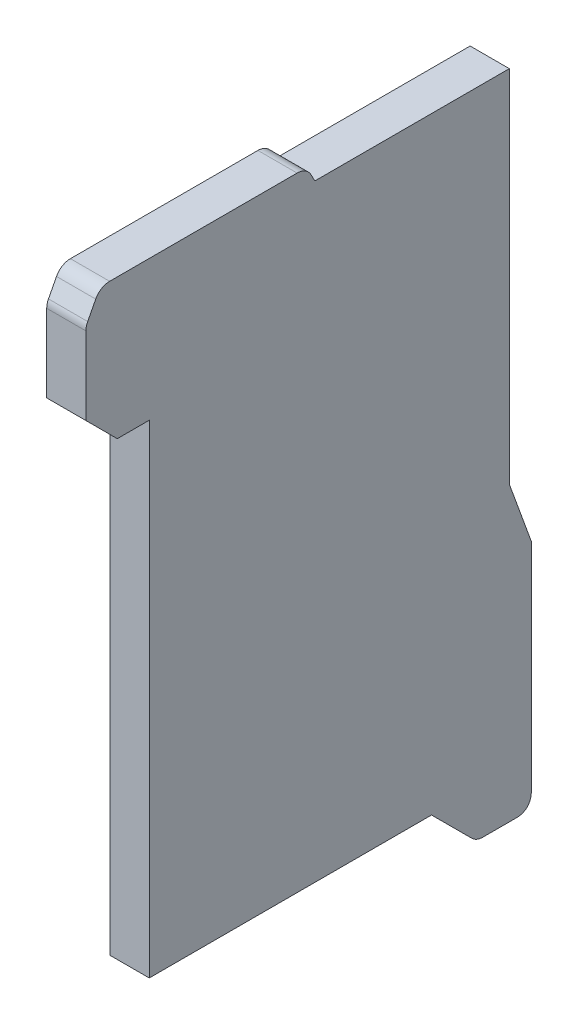
ISO-10303-21;
HEADER;
FILE_DESCRIPTION(('STEP AP214'),'2;1');
FILE_NAME('part.step','',(''),(''),'','','');
FILE_SCHEMA(('AUTOMOTIVE_DESIGN { 1 0 10303 214 1 1 1 1 }'));
ENDSEC;
DATA;
#1=APPLICATION_CONTEXT('core data for automotive mechanical design processes');
#2=APPLICATION_PROTOCOL_DEFINITION('international standard','automotive_design',2000,#1);
#3=PRODUCT_CONTEXT('',#1,'mechanical');
#4=PRODUCT('Part','Part','',(#3));
#5=PRODUCT_RELATED_PRODUCT_CATEGORY('part','',(#4));
#6=PRODUCT_DEFINITION_FORMATION('','',#4);
#7=PRODUCT_DEFINITION_CONTEXT('part definition',#1,'design');
#8=PRODUCT_DEFINITION('design','',#6,#7);
#9=PRODUCT_DEFINITION_SHAPE('','',#8);
#10=(LENGTH_UNIT() NAMED_UNIT(*) SI_UNIT(.MILLI.,.METRE.));
#11=(NAMED_UNIT(*) PLANE_ANGLE_UNIT() SI_UNIT($,.RADIAN.));
#12=(NAMED_UNIT(*) SI_UNIT($,.STERADIAN.) SOLID_ANGLE_UNIT());
#13=UNCERTAINTY_MEASURE_WITH_UNIT(LENGTH_MEASURE(1.E-05),#10,'distance_accuracy_value','');
#14=(GEOMETRIC_REPRESENTATION_CONTEXT(3) GLOBAL_UNCERTAINTY_ASSIGNED_CONTEXT((#13)) GLOBAL_UNIT_ASSIGNED_CONTEXT((#10,
#11,#12)) REPRESENTATION_CONTEXT('',''));
#15=CARTESIAN_POINT('',(0.,0.,0.));
#16=DIRECTION('',(0.,0.,1.));
#17=DIRECTION('',(1.,0.,0.));
#18=AXIS2_PLACEMENT_3D('',#15,#16,#17);
#19=CARTESIAN_POINT('',(-0.064326898654,-13.05343535686,1.691472156339));
#20=DIRECTION('',(1.,0.,0.));
#21=DIRECTION('',(0.,0.935066266637823,0.354472956649733));
#22=AXIS2_PLACEMENT_3D('',#19,#20,#21);
#23=CYLINDRICAL_SURFACE('',#22,0.1);
#24=CARTESIAN_POINT('',(-0.064326898654,-13.05343535686,1.691472156339));
#25=DIRECTION('',(-1.,0.,0.));
#26=DIRECTION('',(0.,1.,0.));
#27=AXIS2_PLACEMENT_3D('',#24,#25,#26);
#28=CIRCLE('',#27,0.1);
#29=CARTESIAN_POINT('',(-0.064326898654,-13.12830514146,1.6251810155));
#30=VERTEX_POINT('',#29);
#31=CARTESIAN_POINT('',(-0.064326898654,-13.15343535686,1.691472156339));
#32=VERTEX_POINT('',#31);
#33=EDGE_CURVE('E11',#30,#32,#28,.T.);
#34=ORIENTED_EDGE('',*,*,#33,.F.);
#35=DIRECTION('',(1.,0.,0.));
#36=VECTOR('',#35,1.);
#37=CARTESIAN_POINT('',(0.060673101346,-13.12830514146,1.6251810155));
#38=LINE('',#37,#36);
#39=CARTESIAN_POINT('',(0.185673101346,-13.12830514146,1.6251810155));
#40=VERTEX_POINT('',#39);
#41=EDGE_CURVE('E25',#30,#40,#38,.T.);
#42=ORIENTED_EDGE('',*,*,#41,.T.);
#43=CARTESIAN_POINT('',(0.185673101346,-13.05343535686,1.691472156339));
#44=DIRECTION('',(1.,0.,0.));
#45=DIRECTION('',(0.,1.,0.));
#46=AXIS2_PLACEMENT_3D('',#43,#44,#45);
#47=CIRCLE('',#46,0.1);
#48=CARTESIAN_POINT('',(0.185673101346,-13.15343535686,1.691472156339));
#49=VERTEX_POINT('',#48);
#50=EDGE_CURVE('E319',#49,#40,#47,.T.);
#51=ORIENTED_EDGE('',*,*,#50,.F.);
#52=DIRECTION('',(1.,0.,0.));
#53=VECTOR('',#52,1.);
#54=CARTESIAN_POINT('',(-0.064326898654,-13.15343535686,1.691472156339));
#55=LINE('',#54,#53);
#56=EDGE_CURVE('E314',#32,#49,#55,.T.);
#57=ORIENTED_EDGE('',*,*,#56,.F.);
#58=EDGE_LOOP('',(#34,#42,#51,#57));
#59=FACE_BOUND('',#58,.T.);
#60=ADVANCED_FACE('F17',(#59),#23,.T.);
#61=CARTESIAN_POINT('',(-0.064326898654,-13.15343535686,1.950050800102));
#62=DIRECTION('',(0.,1.,0.));
#63=DIRECTION('',(0.,0.,-1.));
#64=AXIS2_PLACEMENT_3D('',#61,#62,#63);
#65=PLANE('',#64);
#66=DIRECTION('',(0.,0.,1.));
#67=VECTOR('',#66,1.);
#68=CARTESIAN_POINT('',(0.185673101346,-13.15343535686,1.950050800102));
#69=LINE('',#68,#67);
#70=CARTESIAN_POINT('',(0.185673101346,-13.15343535686,1.908629443865));
#71=VERTEX_POINT('',#70);
#72=EDGE_CURVE('E310',#49,#71,#69,.T.);
#73=ORIENTED_EDGE('',*,*,#72,.T.);
#74=DIRECTION('',(-1.,0.,0.));
#75=VECTOR('',#74,1.);
#76=CARTESIAN_POINT('',(-0.064326898654,-13.15343535686,1.908629443865));
#77=LINE('',#76,#75);
#78=CARTESIAN_POINT('',(-0.064326898654,-13.15343535686,1.908629443865));
#79=VERTEX_POINT('',#78);
#80=EDGE_CURVE('E306',#71,#79,#77,.T.);
#81=ORIENTED_EDGE('',*,*,#80,.T.);
#82=DIRECTION('',(0.,0.,1.));
#83=VECTOR('',#82,1.);
#84=CARTESIAN_POINT('',(-0.064326898654,-13.15343535686,1.950050800102));
#85=LINE('',#84,#83);
#86=EDGE_CURVE('E301',#32,#79,#85,.T.);
#87=ORIENTED_EDGE('',*,*,#86,.F.);
#88=ORIENTED_EDGE('',*,*,#56,.T.);
#89=EDGE_LOOP('',(#73,#81,#87,#88));
#90=FACE_BOUND('',#89,.T.);
#91=ADVANCED_FACE('F334',(#90),#65,.F.);
#92=CARTESIAN_POINT('',(-0.064326898654,-9.003435356864,3.215050800102));
#93=DIRECTION('',(1.,0.,0.));
#94=DIRECTION('',(0.,1.,0.));
#95=AXIS2_PLACEMENT_3D('',#92,#93,#94);
#96=PLANE('',#95);
#97=DIRECTION('',(0.,1.,0.));
#98=VECTOR('',#97,1.);
#99=CARTESIAN_POINT('',(-0.064326898654,-9.067474943962,4.440050800102));
#100=LINE('',#99,#98);
#101=CARTESIAN_POINT('',(-0.064326898654,-9.587014667728,4.440050800102));
#102=VERTEX_POINT('',#101);
#103=CARTESIAN_POINT('',(-0.064326898654,-9.091912334242,4.440050800102));
#104=VERTEX_POINT('',#103);
#105=EDGE_CURVE('E297',#102,#104,#100,.T.);
#106=ORIENTED_EDGE('',*,*,#105,.T.);
#107=CARTESIAN_POINT('',(-0.064326898654,-9.091912334242,4.340050800102));
#108=DIRECTION('',(-1.,0.,0.));
#109=DIRECTION('',(0.,1.,0.));
#110=AXIS2_PLACEMENT_3D('',#107,#108,#109);
#111=CIRCLE('',#110,0.1);
#112=CARTESIAN_POINT('',(-0.064326898654,-9.045791807191,4.428780146908));
#113=VERTEX_POINT('',#112);
#114=EDGE_CURVE('E293',#104,#113,#111,.T.);
#115=ORIENTED_EDGE('',*,*,#114,.T.);
#116=DIRECTION('',(0.,0.887293468057386,-0.4612052705062));
#117=VECTOR('',#116,1.);
#118=CARTESIAN_POINT('',(-0.064326898654,-8.893435356864,4.349586959517));
#119=LINE('',#118,#117);
#120=CARTESIAN_POINT('',(-0.064326898654,-8.947314829813,4.377592909962));
#121=VERTEX_POINT('',#120);
#122=EDGE_CURVE('E289',#113,#121,#119,.T.);
#123=ORIENTED_EDGE('',*,*,#122,.T.);
#124=CARTESIAN_POINT('',(-0.064326898654,-8.993435356864,4.288863563156));
#125=DIRECTION('',(-1.,0.,0.));
#126=DIRECTION('',(0.,1.,0.));
#127=AXIS2_PLACEMENT_3D('',#124,#125,#126);
#128=CIRCLE('',#127,0.1);
#129=CARTESIAN_POINT('',(-0.064326898654,-8.893435356864,4.288863563156));
#130=VERTEX_POINT('',#129);
#131=EDGE_CURVE('E165',#121,#130,#128,.T.);
#132=ORIENTED_EDGE('',*,*,#131,.T.);
#133=DIRECTION('',(0.,0.,-1.));
#134=VECTOR('',#133,1.);
#135=CARTESIAN_POINT('',(-0.064326898654,-8.893435356864,3.033250954698));
#136=LINE('',#135,#134);
#137=CARTESIAN_POINT('',(-0.064326898654,-8.893435356864,3.093333203541));
#138=VERTEX_POINT('',#137);
#139=EDGE_CURVE('E282',#130,#138,#136,.T.);
#140=ORIENTED_EDGE('',*,*,#139,.T.);
#141=CARTESIAN_POINT('',(-0.064326898654,-8.993435356864,3.093333203541));
#142=DIRECTION('',(-1.,0.,0.));
#143=DIRECTION('',(0.,1.,0.));
#144=AXIS2_PLACEMENT_3D('',#141,#142,#143);
#145=CIRCLE('',#144,0.1);
#146=CARTESIAN_POINT('',(-0.064326898654,-8.946483253259,3.005041074973));
#147=VERTEX_POINT('',#146);
#148=EDGE_CURVE('E278',#138,#147,#145,.T.);
#149=ORIENTED_EDGE('',*,*,#148,.T.);
#150=DIRECTION('',(0.,-0.882921285677773,-0.469521036053879));
#151=VECTOR('',#150,1.);
#152=CARTESIAN_POINT('',(-0.064326898654,-8.893435356864,3.033250954698));
#153=LINE('',#152,#151);
#154=CARTESIAN_POINT('',(-0.064326898654,-8.993435356864,2.98007282391));
#155=VERTEX_POINT('',#154);
#156=EDGE_CURVE('E274',#147,#155,#153,.T.);
#157=ORIENTED_EDGE('',*,*,#156,.T.);
#158=DIRECTION('',(0.,0.,-1.));
#159=VECTOR('',#158,1.);
#160=CARTESIAN_POINT('',(-0.064326898654,-8.993435356864,2.98007282391));
#161=LINE('',#160,#159);
#162=CARTESIAN_POINT('',(-0.064326898654,-8.993435356864,1.740050800102));
#163=VERTEX_POINT('',#162);
#164=EDGE_CURVE('E270',#155,#163,#161,.T.);
#165=ORIENTED_EDGE('',*,*,#164,.T.);
#166=DIRECTION('',(0.,-1.,0.));
#167=VECTOR('',#166,1.);
#168=CARTESIAN_POINT('',(-0.064326898654,-11.28878851814,1.740050800102));
#169=LINE('',#168,#167);
#170=CARTESIAN_POINT('',(-0.064326898654,-11.28878851814,1.740050800102));
#171=VERTEX_POINT('',#170);
#172=EDGE_CURVE('E266',#163,#171,#169,.T.);
#173=ORIENTED_EDGE('',*,*,#172,.T.);
#174=DIRECTION('',(0.,-0.939692620785813,-0.342020143325932));
#175=VECTOR('',#174,1.);
#176=CARTESIAN_POINT('',(-0.064326898654,-11.67343535686,1.600050800102));
#177=LINE('',#176,#175);
#178=CARTESIAN_POINT('',(-0.064326898654,-11.67343535686,1.600050800102));
#179=VERTEX_POINT('',#178);
#180=EDGE_CURVE('E262',#171,#179,#177,.T.);
#181=ORIENTED_EDGE('',*,*,#180,.T.);
#182=DIRECTION('',(0.,-1.,0.));
#183=VECTOR('',#182,1.);
#184=CARTESIAN_POINT('',(-0.064326898654,-13.10343535686,1.600050800102));
#185=LINE('',#184,#183);
#186=CARTESIAN_POINT('',(-0.064326898654,-13.06201400062,1.600050800102));
#187=VERTEX_POINT('',#186);
#188=EDGE_CURVE('E258',#179,#187,#185,.T.);
#189=ORIENTED_EDGE('',*,*,#188,.T.);
#190=CARTESIAN_POINT('',(-0.064326898654,-13.06201400062,1.700050800102));
#191=DIRECTION('',(-1.,0.,0.));
#192=DIRECTION('',(0.,1.,0.));
#193=AXIS2_PLACEMENT_3D('',#190,#191,#192);
#194=CIRCLE('',#193,0.1);
#195=EDGE_CURVE('E254',#187,#30,#194,.T.);
#196=ORIENTED_EDGE('',*,*,#195,.T.);
#197=ORIENTED_EDGE('',*,*,#33,.T.);
#198=ORIENTED_EDGE('',*,*,#86,.T.);
#199=CARTESIAN_POINT('',(-0.064326898654,-13.05343535686,1.908629443865));
#200=DIRECTION('',(-1.,0.,0.));
#201=DIRECTION('',(0.,1.,0.));
#202=AXIS2_PLACEMENT_3D('',#199,#200,#201);
#203=CIRCLE('',#202,0.1);
#204=CARTESIAN_POINT('',(-0.064326898654,-13.12414603498,1.979340121983));
#205=VERTEX_POINT('',#204);
#206=EDGE_CURVE('E250',#79,#205,#203,.T.);
#207=ORIENTED_EDGE('',*,*,#206,.T.);
#208=DIRECTION('',(0.,0.707106781186548,0.707106781186548));
#209=VECTOR('',#208,1.);
#210=CARTESIAN_POINT('',(-0.064326898654,-12.86733379447,2.236152362492));
#211=LINE('',#210,#209);
#212=CARTESIAN_POINT('',(-0.064326898654,-12.86733379447,2.236152362492));
#213=VERTEX_POINT('',#212);
#214=EDGE_CURVE('E246',#205,#213,#211,.T.);
#215=ORIENTED_EDGE('',*,*,#214,.T.);
#216=DIRECTION('',(0.,0.,1.));
#217=VECTOR('',#216,1.);
#218=CARTESIAN_POINT('',(-0.064326898654,-12.86733379447,4.036152362492));
#219=LINE('',#218,#217);
#220=CARTESIAN_POINT('',(-0.064326898654,-12.86733379447,4.036152362492));
#221=VERTEX_POINT('',#220);
#222=EDGE_CURVE('E242',#213,#221,#219,.T.);
#223=ORIENTED_EDGE('',*,*,#222,.T.);
#224=DIRECTION('',(0.,1.,0.));
#225=VECTOR('',#224,1.);
#226=CARTESIAN_POINT('',(-0.064326898654,-9.787014667728,4.036152362492));
#227=LINE('',#226,#225);
#228=CARTESIAN_POINT('',(-0.064326898654,-9.787014667728,4.036152362492));
#229=VERTEX_POINT('',#228);
#230=EDGE_CURVE('E238',#221,#229,#227,.T.);
#231=ORIENTED_EDGE('',*,*,#230,.T.);
#232=DIRECTION('',(0.,0.,1.));
#233=VECTOR('',#232,1.);
#234=CARTESIAN_POINT('',(-0.064326898654,-9.787014667728,4.240050800102));
#235=LINE('',#234,#233);
#236=CARTESIAN_POINT('',(-0.064326898654,-9.787014667728,4.240050800102));
#237=VERTEX_POINT('',#236);
#238=EDGE_CURVE('E234',#229,#237,#235,.T.);
#239=ORIENTED_EDGE('',*,*,#238,.T.);
#240=DIRECTION('',(0.,0.707106781186548,0.707106781186548));
#241=VECTOR('',#240,1.);
#242=CARTESIAN_POINT('',(-0.064326898654,-9.587014667728,4.440050800102));
#243=LINE('',#242,#241);
#244=EDGE_CURVE('E230',#237,#102,#243,.T.);
#245=ORIENTED_EDGE('',*,*,#244,.T.);
#246=EDGE_LOOP('',(#106,#115,#123,#132,#140,#149,#157,#165,#173,#181,#189,#196,#197,#198,#207,
#215,#223,#231,#239,#245));
#247=FACE_BOUND('',#246,.T.);
#248=ADVANCED_FACE('F338',(#247),#96,.F.);
#249=CARTESIAN_POINT('',(-0.064326898654,-9.587014667728,4.440050800102));
#250=DIRECTION('',(0.,0.707106781186548,-0.707106781186548));
#251=DIRECTION('',(-1.,0.,0.));
#252=AXIS2_PLACEMENT_3D('',#249,#250,#251);
#253=PLANE('',#252);
#254=DIRECTION('',(0.,0.707106781186548,0.707106781186548));
#255=VECTOR('',#254,1.);
#256=CARTESIAN_POINT('',(0.185673101346,-9.587014667728,4.440050800102));
#257=LINE('',#256,#255);
#258=CARTESIAN_POINT('',(0.185673101346,-9.787014667728,4.240050800102));
#259=VERTEX_POINT('',#258);
#260=CARTESIAN_POINT('',(0.185673101346,-9.587014667728,4.440050800102));
#261=VERTEX_POINT('',#260);
#262=EDGE_CURVE('E226',#259,#261,#257,.T.);
#263=ORIENTED_EDGE('',*,*,#262,.T.);
#264=DIRECTION('',(1.,0.,0.));
#265=VECTOR('',#264,1.);
#266=CARTESIAN_POINT('',(-0.064326898654,-9.587014667728,4.440050800102));
#267=LINE('',#266,#265);
#268=EDGE_CURVE('E221',#102,#261,#267,.T.);
#269=ORIENTED_EDGE('',*,*,#268,.F.);
#270=ORIENTED_EDGE('',*,*,#244,.F.);
#271=DIRECTION('',(1.,0.,0.));
#272=VECTOR('',#271,1.);
#273=CARTESIAN_POINT('',(-0.064326898654,-9.787014667728,4.240050800102));
#274=LINE('',#273,#272);
#275=EDGE_CURVE('E217',#237,#259,#274,.T.);
#276=ORIENTED_EDGE('',*,*,#275,.T.);
#277=EDGE_LOOP('',(#263,#269,#270,#276));
#278=FACE_BOUND('',#277,.T.);
#279=ADVANCED_FACE('F473',(#278),#253,.F.);
#280=CARTESIAN_POINT('',(-0.064326898654,-9.787014667728,4.240050800102));
#281=DIRECTION('',(0.,1.,0.));
#282=DIRECTION('',(0.,0.,-1.));
#283=AXIS2_PLACEMENT_3D('',#280,#281,#282);
#284=PLANE('',#283);
#285=DIRECTION('',(0.,0.,1.));
#286=VECTOR('',#285,1.);
#287=CARTESIAN_POINT('',(0.185673101346,-9.787014667728,4.240050800102));
#288=LINE('',#287,#286);
#289=CARTESIAN_POINT('',(0.185673101346,-9.787014667728,4.036152362492));
#290=VERTEX_POINT('',#289);
#291=EDGE_CURVE('E212',#290,#259,#288,.T.);
#292=ORIENTED_EDGE('',*,*,#291,.T.);
#293=ORIENTED_EDGE('',*,*,#275,.F.);
#294=ORIENTED_EDGE('',*,*,#238,.F.);
#295=DIRECTION('',(1.,0.,0.));
#296=VECTOR('',#295,1.);
#297=CARTESIAN_POINT('',(-0.064326898654,-9.787014667728,4.036152362492));
#298=LINE('',#297,#296);
#299=EDGE_CURVE('E208',#229,#290,#298,.T.);
#300=ORIENTED_EDGE('',*,*,#299,.T.);
#301=EDGE_LOOP('',(#292,#293,#294,#300));
#302=FACE_BOUND('',#301,.T.);
#303=ADVANCED_FACE('F478',(#302),#284,.F.);
#304=CARTESIAN_POINT('',(-0.064326898654,-9.787014667728,4.036152362492));
#305=DIRECTION('',(0.,0.,-1.));
#306=DIRECTION('',(-1.,0.,0.));
#307=AXIS2_PLACEMENT_3D('',#304,#305,#306);
#308=PLANE('',#307);
#309=DIRECTION('',(0.,1.,0.));
#310=VECTOR('',#309,1.);
#311=CARTESIAN_POINT('',(0.185673101346,-9.787014667728,4.036152362492));
#312=LINE('',#311,#310);
#313=CARTESIAN_POINT('',(0.185673101346,-12.86733379447,4.036152362492));
#314=VERTEX_POINT('',#313);
#315=EDGE_CURVE('E203',#314,#290,#312,.T.);
#316=ORIENTED_EDGE('',*,*,#315,.T.);
#317=ORIENTED_EDGE('',*,*,#299,.F.);
#318=ORIENTED_EDGE('',*,*,#230,.F.);
#319=DIRECTION('',(1.,0.,0.));
#320=VECTOR('',#319,1.);
#321=CARTESIAN_POINT('',(-0.064326898654,-12.86733379447,4.036152362492));
#322=LINE('',#321,#320);
#323=EDGE_CURVE('E199',#221,#314,#322,.T.);
#324=ORIENTED_EDGE('',*,*,#323,.T.);
#325=EDGE_LOOP('',(#316,#317,#318,#324));
#326=FACE_BOUND('',#325,.T.);
#327=ADVANCED_FACE('F482',(#326),#308,.F.);
#328=CARTESIAN_POINT('',(-0.064326898654,-12.86733379447,4.036152362492));
#329=DIRECTION('',(0.,1.,0.));
#330=DIRECTION('',(0.,0.,-1.));
#331=AXIS2_PLACEMENT_3D('',#328,#329,#330);
#332=PLANE('',#331);
#333=DIRECTION('',(0.,0.,1.));
#334=VECTOR('',#333,1.);
#335=CARTESIAN_POINT('',(0.185673101346,-12.86733379447,4.036152362492));
#336=LINE('',#335,#334);
#337=CARTESIAN_POINT('',(0.185673101346,-12.86733379447,2.236152362492));
#338=VERTEX_POINT('',#337);
#339=EDGE_CURVE('E194',#338,#314,#336,.T.);
#340=ORIENTED_EDGE('',*,*,#339,.T.);
#341=ORIENTED_EDGE('',*,*,#323,.F.);
#342=ORIENTED_EDGE('',*,*,#222,.F.);
#343=DIRECTION('',(1.,0.,0.));
#344=VECTOR('',#343,1.);
#345=CARTESIAN_POINT('',(-0.064326898654,-12.86733379447,2.236152362492));
#346=LINE('',#345,#344);
#347=EDGE_CURVE('E190',#213,#338,#346,.T.);
#348=ORIENTED_EDGE('',*,*,#347,.T.);
#349=EDGE_LOOP('',(#340,#341,#342,#348));
#350=FACE_BOUND('',#349,.T.);
#351=ADVANCED_FACE('F486',(#350),#332,.F.);
#352=CARTESIAN_POINT('',(-0.064326898654,-12.86733379447,2.236152362492));
#353=DIRECTION('',(0.,0.707106781186548,-0.707106781186548));
#354=DIRECTION('',(-1.,0.,0.));
#355=AXIS2_PLACEMENT_3D('',#352,#353,#354);
#356=PLANE('',#355);
#357=ORIENTED_EDGE('',*,*,#214,.F.);
#358=DIRECTION('',(1.,0.,0.));
#359=VECTOR('',#358,1.);
#360=CARTESIAN_POINT('',(-0.064326898654,-13.12414603498,1.979340121983));
#361=LINE('',#360,#359);
#362=CARTESIAN_POINT('',(0.185673101346,-13.12414603498,1.979340121983));
#363=VERTEX_POINT('',#362);
#364=EDGE_CURVE('E178',#205,#363,#361,.T.);
#365=ORIENTED_EDGE('',*,*,#364,.T.);
#366=DIRECTION('',(0.,0.707106781186548,0.707106781186548));
#367=VECTOR('',#366,1.);
#368=CARTESIAN_POINT('',(0.185673101346,-12.86733379447,2.236152362492));
#369=LINE('',#368,#367);
#370=EDGE_CURVE('E174',#363,#338,#369,.T.);
#371=ORIENTED_EDGE('',*,*,#370,.T.);
#372=ORIENTED_EDGE('',*,*,#347,.F.);
#373=EDGE_LOOP('',(#357,#365,#371,#372));
#374=FACE_BOUND('',#373,.T.);
#375=ADVANCED_FACE('F490',(#374),#356,.F.);
#376=CARTESIAN_POINT('',(0.185673101346,-9.003435356864,3.215050800102));
#377=DIRECTION('',(1.,0.,0.));
#378=DIRECTION('',(0.,1.,0.));
#379=AXIS2_PLACEMENT_3D('',#376,#377,#378);
#380=PLANE('',#379);
#381=DIRECTION('',(0.,0.887293468057386,-0.4612052705062));
#382=VECTOR('',#381,1.);
#383=CARTESIAN_POINT('',(0.185673101346,-8.893435356864,4.349586959517));
#384=LINE('',#383,#382);
#385=CARTESIAN_POINT('',(0.185673101346,-9.045791807191,4.428780146908));
#386=VERTEX_POINT('',#385);
#387=CARTESIAN_POINT('',(0.185673101346,-8.947314829813,4.377592909962));
#388=VERTEX_POINT('',#387);
#389=EDGE_CURVE('E153',#386,#388,#384,.T.);
#390=ORIENTED_EDGE('',*,*,#389,.F.);
#391=CARTESIAN_POINT('',(0.185673101346,-9.091912334242,4.340050800102));
#392=DIRECTION('',(1.,0.,0.));
#393=DIRECTION('',(0.,1.,0.));
#394=AXIS2_PLACEMENT_3D('',#391,#392,#393);
#395=CIRCLE('',#394,0.1);
#396=CARTESIAN_POINT('',(0.185673101346,-9.091912334242,4.440050800102));
#397=VERTEX_POINT('',#396);
#398=EDGE_CURVE('E175',#386,#397,#395,.T.);
#399=ORIENTED_EDGE('',*,*,#398,.T.);
#400=DIRECTION('',(0.,1.,0.));
#401=VECTOR('',#400,1.);
#402=CARTESIAN_POINT('',(0.185673101346,-9.067474943962,4.440050800102));
#403=LINE('',#402,#401);
#404=EDGE_CURVE('E180',#261,#397,#403,.T.);
#405=ORIENTED_EDGE('',*,*,#404,.F.);
#406=ORIENTED_EDGE('',*,*,#262,.F.);
#407=ORIENTED_EDGE('',*,*,#291,.F.);
#408=ORIENTED_EDGE('',*,*,#315,.F.);
#409=ORIENTED_EDGE('',*,*,#339,.F.);
#410=ORIENTED_EDGE('',*,*,#370,.F.);
#411=CARTESIAN_POINT('',(0.185673101346,-13.05343535686,1.908629443865));
#412=DIRECTION('',(1.,0.,0.));
#413=DIRECTION('',(0.,1.,0.));
#414=AXIS2_PLACEMENT_3D('',#411,#412,#413);
#415=CIRCLE('',#414,0.1);
#416=EDGE_CURVE('E346',#363,#71,#415,.T.);
#417=ORIENTED_EDGE('',*,*,#416,.T.);
#418=ORIENTED_EDGE('',*,*,#72,.F.);
#419=ORIENTED_EDGE('',*,*,#50,.T.);
#420=CARTESIAN_POINT('',(0.185673101346,-13.06201400062,1.700050800102));
#421=DIRECTION('',(1.,0.,0.));
#422=DIRECTION('',(0.,1.,0.));
#423=AXIS2_PLACEMENT_3D('',#420,#421,#422);
#424=CIRCLE('',#423,0.1);
#425=CARTESIAN_POINT('',(0.185673101346,-13.06201400062,1.600050800102));
#426=VERTEX_POINT('',#425);
#427=EDGE_CURVE('E329',#40,#426,#424,.T.);
#428=ORIENTED_EDGE('',*,*,#427,.T.);
#429=DIRECTION('',(0.,-1.,0.));
#430=VECTOR('',#429,1.);
#431=CARTESIAN_POINT('',(0.185673101346,-13.10343535686,1.600050800102));
#432=LINE('',#431,#430);
#433=CARTESIAN_POINT('',(0.185673101346,-11.67343535686,1.600050800102));
#434=VERTEX_POINT('',#433);
#435=EDGE_CURVE('E347',#434,#426,#432,.T.);
#436=ORIENTED_EDGE('',*,*,#435,.F.);
#437=DIRECTION('',(0.,-0.939692620785813,-0.342020143325932));
#438=VECTOR('',#437,1.);
#439=CARTESIAN_POINT('',(0.185673101346,-11.67343535686,1.600050800102));
#440=LINE('',#439,#438);
#441=CARTESIAN_POINT('',(0.185673101346,-11.28878851814,1.740050800102));
#442=VERTEX_POINT('',#441);
#443=EDGE_CURVE('E350',#442,#434,#440,.T.);
#444=ORIENTED_EDGE('',*,*,#443,.F.);
#445=DIRECTION('',(0.,-1.,0.));
#446=VECTOR('',#445,1.);
#447=CARTESIAN_POINT('',(0.185673101346,-11.28878851814,1.740050800102));
#448=LINE('',#447,#446);
#449=CARTESIAN_POINT('',(0.185673101346,-8.993435356864,1.740050800102));
#450=VERTEX_POINT('',#449);
#451=EDGE_CURVE('E437',#450,#442,#448,.T.);
#452=ORIENTED_EDGE('',*,*,#451,.F.);
#453=DIRECTION('',(0.,0.,-1.));
#454=VECTOR('',#453,1.);
#455=CARTESIAN_POINT('',(0.185673101346,-8.993435356864,2.98007282391));
#456=LINE('',#455,#454);
#457=CARTESIAN_POINT('',(0.185673101346,-8.993435356864,2.98007282391));
#458=VERTEX_POINT('',#457);
#459=EDGE_CURVE('E432',#458,#450,#456,.T.);
#460=ORIENTED_EDGE('',*,*,#459,.F.);
#461=DIRECTION('',(0.,-0.882921285677773,-0.469521036053879));
#462=VECTOR('',#461,1.);
#463=CARTESIAN_POINT('',(0.185673101346,-8.893435356864,3.033250954698));
#464=LINE('',#463,#462);
#465=CARTESIAN_POINT('',(0.185673101346,-8.946483253259,3.005041074973));
#466=VERTEX_POINT('',#465);
#467=EDGE_CURVE('E427',#466,#458,#464,.T.);
#468=ORIENTED_EDGE('',*,*,#467,.F.);
#469=CARTESIAN_POINT('',(0.185673101346,-8.993435356864,3.093333203541));
#470=DIRECTION('',(1.,0.,0.));
#471=DIRECTION('',(0.,1.,0.));
#472=AXIS2_PLACEMENT_3D('',#469,#470,#471);
#473=CIRCLE('',#472,0.1);
#474=CARTESIAN_POINT('',(0.185673101346,-8.893435356864,3.093333203541));
#475=VERTEX_POINT('',#474);
#476=EDGE_CURVE('E423',#466,#475,#473,.T.);
#477=ORIENTED_EDGE('',*,*,#476,.T.);
#478=DIRECTION('',(0.,0.,-1.));
#479=VECTOR('',#478,1.);
#480=CARTESIAN_POINT('',(0.185673101346,-8.893435356864,3.033250954698));
#481=LINE('',#480,#479);
#482=CARTESIAN_POINT('',(0.185673101346,-8.893435356864,4.288863563156));
#483=VERTEX_POINT('',#482);
#484=EDGE_CURVE('E156',#483,#475,#481,.T.);
#485=ORIENTED_EDGE('',*,*,#484,.F.);
#486=CARTESIAN_POINT('',(0.185673101346,-8.993435356864,4.288863563156));
#487=DIRECTION('',(1.,0.,0.));
#488=DIRECTION('',(0.,1.,0.));
#489=AXIS2_PLACEMENT_3D('',#486,#487,#488);
#490=CIRCLE('',#489,0.1);
#491=EDGE_CURVE('E149',#483,#388,#490,.T.);
#492=ORIENTED_EDGE('',*,*,#491,.T.);
#493=EDGE_LOOP('',(#390,#399,#405,#406,#407,#408,#409,#410,#417,#418,#419,#428,#436,#444,#452,
#460,#468,#477,#485,#492));
#494=FACE_BOUND('',#493,.T.);
#495=ADVANCED_FACE('F151',(#494),#380,.T.);
#496=CARTESIAN_POINT('',(-0.064326898654,-8.993435356864,4.288863563156));
#497=DIRECTION('',(1.,0.,0.));
#498=DIRECTION('',(0.,-0.854752965369973,-0.519035035610543));
#499=AXIS2_PLACEMENT_3D('',#496,#497,#498);
#500=CYLINDRICAL_SURFACE('',#499,0.1);
#501=ORIENTED_EDGE('',*,*,#131,.F.);
#502=DIRECTION('',(-1.,0.,0.));
#503=VECTOR('',#502,1.);
#504=CARTESIAN_POINT('',(-0.064326898654,-8.947314829813,4.377592909962));
#505=LINE('',#504,#503);
#506=EDGE_CURVE('E160',#388,#121,#505,.T.);
#507=ORIENTED_EDGE('',*,*,#506,.F.);
#508=ORIENTED_EDGE('',*,*,#491,.F.);
#509=DIRECTION('',(1.,0.,0.));
#510=VECTOR('',#509,1.);
#511=CARTESIAN_POINT('',(-0.064326898654,-8.893435356864,4.288863563156));
#512=LINE('',#511,#510);
#513=EDGE_CURVE('E168',#130,#483,#512,.T.);
#514=ORIENTED_EDGE('',*,*,#513,.F.);
#515=EDGE_LOOP('',(#501,#507,#508,#514));
#516=FACE_BOUND('',#515,.T.);
#517=ADVANCED_FACE('F164',(#516),#500,.T.);
#518=CARTESIAN_POINT('',(-0.064326898654,-8.893435356864,3.033250954698));
#519=DIRECTION('',(0.,-1.,0.));
#520=DIRECTION('',(0.,0.,-1.));
#521=AXIS2_PLACEMENT_3D('',#518,#519,#520);
#522=PLANE('',#521);
#523=ORIENTED_EDGE('',*,*,#139,.F.);
#524=ORIENTED_EDGE('',*,*,#513,.T.);
#525=ORIENTED_EDGE('',*,*,#484,.T.);
#526=DIRECTION('',(-1.,0.,0.));
#527=VECTOR('',#526,1.);
#528=CARTESIAN_POINT('',(-0.064326898654,-8.893435356864,3.093333203541));
#529=LINE('',#528,#527);
#530=EDGE_CURVE('E408',#475,#138,#529,.T.);
#531=ORIENTED_EDGE('',*,*,#530,.T.);
#532=EDGE_LOOP('',(#523,#524,#525,#531));
#533=FACE_BOUND('',#532,.T.);
#534=ADVANCED_FACE('F499',(#533),#522,.F.);
#535=CARTESIAN_POINT('',(-0.064326898654,-8.993435356864,3.093333203541));
#536=DIRECTION('',(1.,0.,0.));
#537=DIRECTION('',(0.,-0.857181729871185,0.515014059978019));
#538=AXIS2_PLACEMENT_3D('',#535,#536,#537);
#539=CYLINDRICAL_SURFACE('',#538,0.1);
#540=ORIENTED_EDGE('',*,*,#148,.F.);
#541=ORIENTED_EDGE('',*,*,#530,.F.);
#542=ORIENTED_EDGE('',*,*,#476,.F.);
#543=DIRECTION('',(1.,0.,0.));
#544=VECTOR('',#543,1.);
#545=CARTESIAN_POINT('',(-0.064326898654,-8.946483253259,3.005041074973));
#546=LINE('',#545,#544);
#547=EDGE_CURVE('E403',#147,#466,#546,.T.);
#548=ORIENTED_EDGE('',*,*,#547,.F.);
#549=EDGE_LOOP('',(#540,#541,#542,#548));
#550=FACE_BOUND('',#549,.T.);
#551=ADVANCED_FACE('F502',(#550),#539,.T.);
#552=CARTESIAN_POINT('',(-0.064326898654,-8.893435356864,3.033250954698));
#553=DIRECTION('',(0.,-0.469521036053879,0.882921285677773));
#554=DIRECTION('',(-1.,0.,0.));
#555=AXIS2_PLACEMENT_3D('',#552,#553,#554);
#556=PLANE('',#555);
#557=ORIENTED_EDGE('',*,*,#156,.F.);
#558=ORIENTED_EDGE('',*,*,#547,.T.);
#559=ORIENTED_EDGE('',*,*,#467,.T.);
#560=DIRECTION('',(1.,0.,0.));
#561=VECTOR('',#560,1.);
#562=CARTESIAN_POINT('',(-0.064326898654,-8.993435356864,2.98007282391));
#563=LINE('',#562,#561);
#564=EDGE_CURVE('E398',#155,#458,#563,.T.);
#565=ORIENTED_EDGE('',*,*,#564,.F.);
#566=EDGE_LOOP('',(#557,#558,#559,#565));
#567=FACE_BOUND('',#566,.T.);
#568=ADVANCED_FACE('F506',(#567),#556,.F.);
#569=CARTESIAN_POINT('',(-0.064326898654,-8.993435356864,2.98007282391));
#570=DIRECTION('',(0.,-1.,0.));
#571=DIRECTION('',(0.,0.,-1.));
#572=AXIS2_PLACEMENT_3D('',#569,#570,#571);
#573=PLANE('',#572);
#574=ORIENTED_EDGE('',*,*,#459,.T.);
#575=DIRECTION('',(1.,0.,0.));
#576=VECTOR('',#575,1.);
#577=CARTESIAN_POINT('',(-0.064326898654,-8.993435356864,1.740050800102));
#578=LINE('',#577,#576);
#579=EDGE_CURVE('E393',#163,#450,#578,.T.);
#580=ORIENTED_EDGE('',*,*,#579,.F.);
#581=ORIENTED_EDGE('',*,*,#164,.F.);
#582=ORIENTED_EDGE('',*,*,#564,.T.);
#583=EDGE_LOOP('',(#574,#580,#581,#582));
#584=FACE_BOUND('',#583,.T.);
#585=ADVANCED_FACE('F510',(#584),#573,.F.);
#586=CARTESIAN_POINT('',(-0.064326898654,-11.28878851814,1.740050800102));
#587=DIRECTION('',(0.,0.,1.));
#588=DIRECTION('',(0.,-1.,0.));
#589=AXIS2_PLACEMENT_3D('',#586,#587,#588);
#590=PLANE('',#589);
#591=ORIENTED_EDGE('',*,*,#451,.T.);
#592=DIRECTION('',(1.,0.,0.));
#593=VECTOR('',#592,1.);
#594=CARTESIAN_POINT('',(-0.064326898654,-11.28878851814,1.740050800102));
#595=LINE('',#594,#593);
#596=EDGE_CURVE('E388',#171,#442,#595,.T.);
#597=ORIENTED_EDGE('',*,*,#596,.F.);
#598=ORIENTED_EDGE('',*,*,#172,.F.);
#599=ORIENTED_EDGE('',*,*,#579,.T.);
#600=EDGE_LOOP('',(#591,#597,#598,#599));
#601=FACE_BOUND('',#600,.T.);
#602=ADVANCED_FACE('F462',(#601),#590,.F.);
#603=CARTESIAN_POINT('',(-0.064326898654,-11.67343535686,1.600050800102));
#604=DIRECTION('',(0.,-0.342020143325932,0.939692620785813));
#605=DIRECTION('',(-1.,0.,0.));
#606=AXIS2_PLACEMENT_3D('',#603,#604,#605);
#607=PLANE('',#606);
#608=ORIENTED_EDGE('',*,*,#443,.T.);
#609=DIRECTION('',(1.,0.,0.));
#610=VECTOR('',#609,1.);
#611=CARTESIAN_POINT('',(-0.064326898654,-11.67343535686,1.600050800102));
#612=LINE('',#611,#610);
#613=EDGE_CURVE('E383',#179,#434,#612,.T.);
#614=ORIENTED_EDGE('',*,*,#613,.F.);
#615=ORIENTED_EDGE('',*,*,#180,.F.);
#616=ORIENTED_EDGE('',*,*,#596,.T.);
#617=EDGE_LOOP('',(#608,#614,#615,#616));
#618=FACE_BOUND('',#617,.T.);
#619=ADVANCED_FACE('F449',(#618),#607,.F.);
#620=CARTESIAN_POINT('',(-0.064326898654,-13.10343535686,1.600050800102));
#621=DIRECTION('',(0.,0.,1.));
#622=DIRECTION('',(0.,-1.,0.));
#623=AXIS2_PLACEMENT_3D('',#620,#621,#622);
#624=PLANE('',#623);
#625=ORIENTED_EDGE('',*,*,#435,.T.);
#626=DIRECTION('',(-1.,0.,0.));
#627=VECTOR('',#626,1.);
#628=CARTESIAN_POINT('',(-0.064326898654,-13.06201400062,1.600050800102));
#629=LINE('',#628,#627);
#630=EDGE_CURVE('E344',#426,#187,#629,.T.);
#631=ORIENTED_EDGE('',*,*,#630,.T.);
#632=ORIENTED_EDGE('',*,*,#188,.F.);
#633=ORIENTED_EDGE('',*,*,#613,.T.);
#634=EDGE_LOOP('',(#625,#631,#632,#633));
#635=FACE_BOUND('',#634,.T.);
#636=ADVANCED_FACE('F453',(#635),#624,.F.);
#637=CARTESIAN_POINT('',(-0.064326898654,-13.06201400062,1.700050800102));
#638=DIRECTION('',(1.,0.,0.));
#639=DIRECTION('',(0.,0.354472956647036,0.935066266638846));
#640=AXIS2_PLACEMENT_3D('',#637,#638,#639);
#641=CYLINDRICAL_SURFACE('',#640,0.1);
#642=ORIENTED_EDGE('',*,*,#41,.F.);
#643=ORIENTED_EDGE('',*,*,#195,.F.);
#644=ORIENTED_EDGE('',*,*,#630,.F.);
#645=ORIENTED_EDGE('',*,*,#427,.F.);
#646=EDGE_LOOP('',(#642,#643,#644,#645));
#647=FACE_BOUND('',#646,.T.);
#648=ADVANCED_FACE('F343',(#647),#641,.T.);
#649=CARTESIAN_POINT('',(-0.064326898654,-8.893435356864,4.349586959517));
#650=DIRECTION('',(0.,-0.4612052705062,-0.887293468057386));
#651=DIRECTION('',(0.,-0.887293468057386,0.4612052705062));
#652=AXIS2_PLACEMENT_3D('',#649,#650,#651);
#653=PLANE('',#652);
#654=ORIENTED_EDGE('',*,*,#122,.F.);
#655=DIRECTION('',(1.,0.,0.));
#656=VECTOR('',#655,1.);
#657=CARTESIAN_POINT('',(-0.064326898654,-9.045791807191,4.428780146908));
#658=LINE('',#657,#656);
#659=EDGE_CURVE('E172',#113,#386,#658,.T.);
#660=ORIENTED_EDGE('',*,*,#659,.T.);
#661=ORIENTED_EDGE('',*,*,#389,.T.);
#662=ORIENTED_EDGE('',*,*,#506,.T.);
#663=EDGE_LOOP('',(#654,#660,#661,#662));
#664=FACE_BOUND('',#663,.T.);
#665=ADVANCED_FACE('F170',(#664),#653,.F.);
#666=CARTESIAN_POINT('',(-0.064326898654,-9.091912334242,4.340050800102));
#667=DIRECTION('',(1.,0.,0.));
#668=DIRECTION('',(0.,-0.237388428470736,-0.971414810484272));
#669=AXIS2_PLACEMENT_3D('',#666,#667,#668);
#670=CYLINDRICAL_SURFACE('',#669,0.1);
#671=ORIENTED_EDGE('',*,*,#114,.F.);
#672=DIRECTION('',(-1.,0.,0.));
#673=VECTOR('',#672,1.);
#674=CARTESIAN_POINT('',(-0.064326898654,-9.091912334242,4.440050800102));
#675=LINE('',#674,#673);
#676=EDGE_CURVE('E368',#397,#104,#675,.T.);
#677=ORIENTED_EDGE('',*,*,#676,.F.);
#678=ORIENTED_EDGE('',*,*,#398,.F.);
#679=ORIENTED_EDGE('',*,*,#659,.F.);
#680=EDGE_LOOP('',(#671,#677,#678,#679));
#681=FACE_BOUND('',#680,.T.);
#682=ADVANCED_FACE('F374',(#681),#670,.T.);
#683=CARTESIAN_POINT('',(-0.064326898654,-9.067474943962,4.440050800102));
#684=DIRECTION('',(0.,0.,-1.));
#685=DIRECTION('',(-1.,0.,0.));
#686=AXIS2_PLACEMENT_3D('',#683,#684,#685);
#687=PLANE('',#686);
#688=ORIENTED_EDGE('',*,*,#404,.T.);
#689=ORIENTED_EDGE('',*,*,#676,.T.);
#690=ORIENTED_EDGE('',*,*,#105,.F.);
#691=ORIENTED_EDGE('',*,*,#268,.T.);
#692=EDGE_LOOP('',(#688,#689,#690,#691));
#693=FACE_BOUND('',#692,.T.);
#694=ADVANCED_FACE('F365',(#693),#687,.F.);
#695=CARTESIAN_POINT('',(-0.064326898654,-13.05343535686,1.908629443865));
#696=DIRECTION('',(1.,0.,0.));
#697=DIRECTION('',(0.,0.923879532513987,-0.382683432358572));
#698=AXIS2_PLACEMENT_3D('',#695,#696,#697);
#699=CYLINDRICAL_SURFACE('',#698,0.1);
#700=ORIENTED_EDGE('',*,*,#206,.F.);
#701=ORIENTED_EDGE('',*,*,#80,.F.);
#702=ORIENTED_EDGE('',*,*,#416,.F.);
#703=ORIENTED_EDGE('',*,*,#364,.F.);
#704=EDGE_LOOP('',(#700,#701,#702,#703));
#705=FACE_BOUND('',#704,.T.);
#706=ADVANCED_FACE('F544',(#705),#699,.T.);
#707=CLOSED_SHELL('',(#60,#91,#248,#279,#303,#327,#351,#375,#495,#517,#534,#551,#568,#585,#602,
#619,#636,#648,#665,#682,#694,#706));
#708=MANIFOLD_SOLID_BREP('B1',#707);
#709=ADVANCED_BREP_SHAPE_REPRESENTATION('',(#18,#708),#14);
#710=SHAPE_DEFINITION_REPRESENTATION(#9,#709);
ENDSEC;
END-ISO-10303-21;
